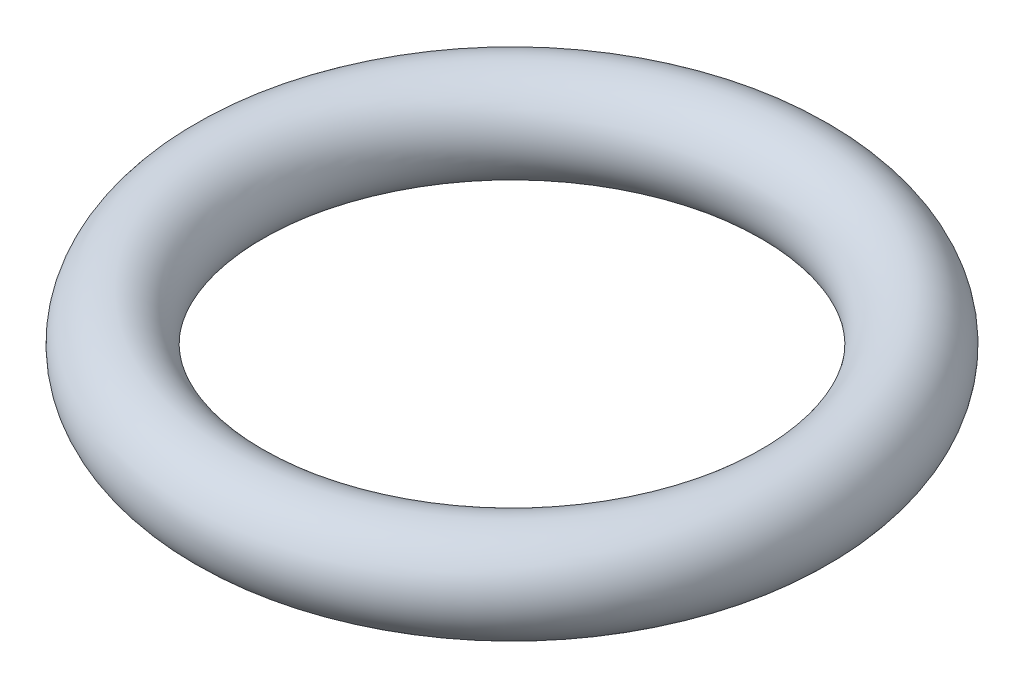
ISO-10303-21;
HEADER;
FILE_DESCRIPTION(('STEP AP214'),'2;1');
FILE_NAME('part.step','',(''),(''),'','','');
FILE_SCHEMA(('AUTOMOTIVE_DESIGN { 1 0 10303 214 1 1 1 1 }'));
ENDSEC;
DATA;
#1=APPLICATION_CONTEXT('core data for automotive mechanical design processes');
#2=APPLICATION_PROTOCOL_DEFINITION('international standard','automotive_design',2000,#1);
#3=PRODUCT_CONTEXT('',#1,'mechanical');
#4=PRODUCT('Part','Part','',(#3));
#5=PRODUCT_RELATED_PRODUCT_CATEGORY('part','',(#4));
#6=PRODUCT_DEFINITION_FORMATION('','',#4);
#7=PRODUCT_DEFINITION_CONTEXT('part definition',#1,'design');
#8=PRODUCT_DEFINITION('design','',#6,#7);
#9=PRODUCT_DEFINITION_SHAPE('','',#8);
#10=(LENGTH_UNIT() NAMED_UNIT(*) SI_UNIT(.MILLI.,.METRE.));
#11=(NAMED_UNIT(*) PLANE_ANGLE_UNIT() SI_UNIT($,.RADIAN.));
#12=(NAMED_UNIT(*) SI_UNIT($,.STERADIAN.) SOLID_ANGLE_UNIT());
#13=UNCERTAINTY_MEASURE_WITH_UNIT(LENGTH_MEASURE(1.E-05),#10,'distance_accuracy_value','');
#14=(GEOMETRIC_REPRESENTATION_CONTEXT(3) GLOBAL_UNCERTAINTY_ASSIGNED_CONTEXT((#13)) GLOBAL_UNIT_ASSIGNED_CONTEXT((#10,
#11,#12)) REPRESENTATION_CONTEXT('',''));
#15=CARTESIAN_POINT('',(0.,0.,0.));
#16=DIRECTION('',(0.,0.,1.));
#17=DIRECTION('',(1.,0.,0.));
#18=AXIS2_PLACEMENT_3D('',#15,#16,#17);
#19=CARTESIAN_POINT('',(0.,0.,0.));
#20=DIRECTION('',(0.,1.,0.));
#21=DIRECTION('',(0.,0.,1.));
#22=AXIS2_PLACEMENT_3D('',#19,#20,#21);
#23=TOROIDAL_SURFACE('',#22,152.4,25.4);
#24=CARTESIAN_POINT('',(0.,0.,152.4));
#25=DIRECTION('',(1.,0.,0.));
#26=DIRECTION('',(0.,0.,-1.));
#27=AXIS2_PLACEMENT_3D('',#24,#25,#26);
#28=CIRCLE('',#27,25.4);
#29=CARTESIAN_POINT('',(0.,0.,177.8));
#30=VERTEX_POINT('',#29);
#31=EDGE_CURVE('E11',#30,#30,#28,.T.);
#32=CARTESIAN_POINT('',(0.,0.,0.));
#33=DIRECTION('',(0.,1.,0.));
#34=DIRECTION('',(0.,0.,1.));
#35=AXIS2_PLACEMENT_3D('',#32,#33,#34);
#36=CIRCLE('',#35,177.8);
#37=EDGE_CURVE('',#30,#30,#36,.T.);
#38=ORIENTED_EDGE('',*,*,#31,.T.);
#39=ORIENTED_EDGE('',*,*,#31,.F.);
#40=ORIENTED_EDGE('',*,*,#37,.T.);
#41=ORIENTED_EDGE('',*,*,#37,.F.);
#42=EDGE_LOOP('',(#38,#40,#39,#41));
#43=FACE_BOUND('',#42,.T.);
#44=ADVANCED_FACE('F50',(#43),#23,.T.);
#45=CLOSED_SHELL('',(#44));
#46=MANIFOLD_SOLID_BREP('B2',#45);
#47=ADVANCED_BREP_SHAPE_REPRESENTATION('',(#18,#46),#14);
#48=SHAPE_DEFINITION_REPRESENTATION(#9,#47);
ENDSEC;
END-ISO-10303-21;
